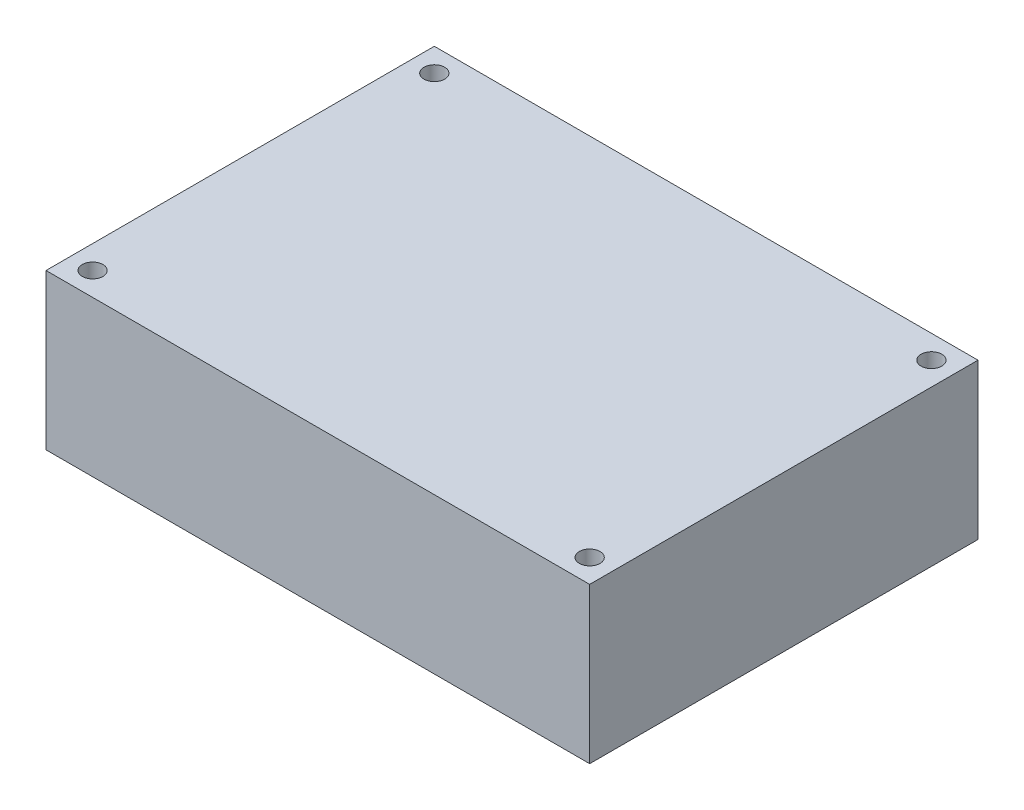
ISO-10303-21;
HEADER;
FILE_DESCRIPTION(('STEP AP214'),'2;1');
FILE_NAME('part.step','',(''),(''),'','','');
FILE_SCHEMA(('AUTOMOTIVE_DESIGN { 1 0 10303 214 1 1 1 1 }'));
ENDSEC;
DATA;
#1=APPLICATION_CONTEXT('core data for automotive mechanical design processes');
#2=APPLICATION_PROTOCOL_DEFINITION('international standard','automotive_design',2000,#1);
#3=PRODUCT_CONTEXT('',#1,'mechanical');
#4=PRODUCT('Part','Part','',(#3));
#5=PRODUCT_RELATED_PRODUCT_CATEGORY('part','',(#4));
#6=PRODUCT_DEFINITION_FORMATION('','',#4);
#7=PRODUCT_DEFINITION_CONTEXT('part definition',#1,'design');
#8=PRODUCT_DEFINITION('design','',#6,#7);
#9=PRODUCT_DEFINITION_SHAPE('','',#8);
#10=(LENGTH_UNIT() NAMED_UNIT(*) SI_UNIT(.MILLI.,.METRE.));
#11=(NAMED_UNIT(*) PLANE_ANGLE_UNIT() SI_UNIT($,.RADIAN.));
#12=(NAMED_UNIT(*) SI_UNIT($,.STERADIAN.) SOLID_ANGLE_UNIT());
#13=UNCERTAINTY_MEASURE_WITH_UNIT(LENGTH_MEASURE(1.E-05),#10,'distance_accuracy_value','');
#14=(GEOMETRIC_REPRESENTATION_CONTEXT(3) GLOBAL_UNCERTAINTY_ASSIGNED_CONTEXT((#13)) GLOBAL_UNIT_ASSIGNED_CONTEXT((#10,
#11,#12)) REPRESENTATION_CONTEXT('',''));
#15=CARTESIAN_POINT('',(0.,0.,0.));
#16=DIRECTION('',(0.,0.,1.));
#17=DIRECTION('',(1.,0.,0.));
#18=AXIS2_PLACEMENT_3D('',#15,#16,#17);
#19=CARTESIAN_POINT('',(-52.5,15.,-37.5));
#20=DIRECTION('',(1.,0.,0.));
#21=DIRECTION('',(0.,0.,-1.));
#22=AXIS2_PLACEMENT_3D('',#19,#20,#21);
#23=PLANE('',#22);
#24=DIRECTION('',(0.,0.,1.));
#25=VECTOR('',#24,1.);
#26=CARTESIAN_POINT('',(-52.5,-15.,-37.5));
#27=LINE('',#26,#25);
#28=CARTESIAN_POINT('',(-52.5,-15.,-37.5));
#29=VERTEX_POINT('',#28);
#30=CARTESIAN_POINT('',(-52.5,-15.,37.5));
#31=VERTEX_POINT('',#30);
#32=EDGE_CURVE('E96',#29,#31,#27,.T.);
#33=ORIENTED_EDGE('',*,*,#32,.T.);
#34=DIRECTION('',(0.,-1.,0.));
#35=VECTOR('',#34,1.);
#36=CARTESIAN_POINT('',(-52.5,15.,37.5));
#37=LINE('',#36,#35);
#38=CARTESIAN_POINT('',(-52.5,15.,37.5));
#39=VERTEX_POINT('',#38);
#40=EDGE_CURVE('E11',#39,#31,#37,.T.);
#41=ORIENTED_EDGE('',*,*,#40,.F.);
#42=DIRECTION('',(0.,0.,1.));
#43=VECTOR('',#42,1.);
#44=CARTESIAN_POINT('',(-52.5,15.,-37.5));
#45=LINE('',#44,#43);
#46=CARTESIAN_POINT('',(-52.5,15.,-37.5));
#47=VERTEX_POINT('',#46);
#48=EDGE_CURVE('E84',#47,#39,#45,.T.);
#49=ORIENTED_EDGE('',*,*,#48,.F.);
#50=DIRECTION('',(0.,-1.,0.));
#51=VECTOR('',#50,1.);
#52=CARTESIAN_POINT('',(-52.5,15.,-37.5));
#53=LINE('',#52,#51);
#54=EDGE_CURVE('E92',#47,#29,#53,.T.);
#55=ORIENTED_EDGE('',*,*,#54,.T.);
#56=EDGE_LOOP('',(#33,#41,#49,#55));
#57=FACE_BOUND('',#56,.T.);
#58=ADVANCED_FACE('F33',(#57),#23,.F.);
#59=CARTESIAN_POINT('',(-52.5,15.,37.5));
#60=DIRECTION('',(0.,0.,-1.));
#61=DIRECTION('',(-1.,0.,0.));
#62=AXIS2_PLACEMENT_3D('',#59,#60,#61);
#63=PLANE('',#62);
#64=DIRECTION('',(1.,0.,0.));
#65=VECTOR('',#64,1.);
#66=CARTESIAN_POINT('',(-52.5,-15.,37.5));
#67=LINE('',#66,#65);
#68=CARTESIAN_POINT('',(52.5,-15.,37.5));
#69=VERTEX_POINT('',#68);
#70=EDGE_CURVE('E88',#31,#69,#67,.T.);
#71=ORIENTED_EDGE('',*,*,#70,.T.);
#72=DIRECTION('',(0.,-1.,0.));
#73=VECTOR('',#72,1.);
#74=CARTESIAN_POINT('',(52.5,15.,37.5));
#75=LINE('',#74,#73);
#76=CARTESIAN_POINT('',(52.5,15.,37.5));
#77=VERTEX_POINT('',#76);
#78=EDGE_CURVE('E41',#77,#69,#75,.T.);
#79=ORIENTED_EDGE('',*,*,#78,.F.);
#80=DIRECTION('',(1.,0.,0.));
#81=VECTOR('',#80,1.);
#82=CARTESIAN_POINT('',(-52.5,15.,37.5));
#83=LINE('',#82,#81);
#84=EDGE_CURVE('E79',#39,#77,#83,.T.);
#85=ORIENTED_EDGE('',*,*,#84,.F.);
#86=ORIENTED_EDGE('',*,*,#40,.T.);
#87=EDGE_LOOP('',(#71,#79,#85,#86));
#88=FACE_BOUND('',#87,.T.);
#89=ADVANCED_FACE('F87',(#88),#63,.F.);
#90=CARTESIAN_POINT('',(52.5,15.,-37.5));
#91=DIRECTION('',(-1.,0.,0.));
#92=DIRECTION('',(0.,0.,1.));
#93=AXIS2_PLACEMENT_3D('',#90,#91,#92);
#94=PLANE('',#93);
#95=DIRECTION('',(0.,0.,-1.));
#96=VECTOR('',#95,1.);
#97=CARTESIAN_POINT('',(52.5,-15.,-37.5));
#98=LINE('',#97,#96);
#99=CARTESIAN_POINT('',(52.5,-15.,-37.5));
#100=VERTEX_POINT('',#99);
#101=EDGE_CURVE('E66',#69,#100,#98,.T.);
#102=ORIENTED_EDGE('',*,*,#101,.T.);
#103=DIRECTION('',(0.,-1.,0.));
#104=VECTOR('',#103,1.);
#105=CARTESIAN_POINT('',(52.5,15.,-37.5));
#106=LINE('',#105,#104);
#107=CARTESIAN_POINT('',(52.5,15.,-37.5));
#108=VERTEX_POINT('',#107);
#109=EDGE_CURVE('E89',#108,#100,#106,.T.);
#110=ORIENTED_EDGE('',*,*,#109,.F.);
#111=DIRECTION('',(0.,0.,-1.));
#112=VECTOR('',#111,1.);
#113=CARTESIAN_POINT('',(52.5,15.,-37.5));
#114=LINE('',#113,#112);
#115=EDGE_CURVE('E82',#77,#108,#114,.T.);
#116=ORIENTED_EDGE('',*,*,#115,.F.);
#117=ORIENTED_EDGE('',*,*,#78,.T.);
#118=EDGE_LOOP('',(#102,#110,#116,#117));
#119=FACE_BOUND('',#118,.T.);
#120=ADVANCED_FACE('F90',(#119),#94,.F.);
#121=CARTESIAN_POINT('',(-52.5,15.,-37.5));
#122=DIRECTION('',(0.,0.,1.));
#123=DIRECTION('',(1.,0.,0.));
#124=AXIS2_PLACEMENT_3D('',#121,#122,#123);
#125=PLANE('',#124);
#126=DIRECTION('',(-1.,0.,0.));
#127=VECTOR('',#126,1.);
#128=CARTESIAN_POINT('',(-52.5,-15.,-37.5));
#129=LINE('',#128,#127);
#130=EDGE_CURVE('E72',#100,#29,#129,.T.);
#131=ORIENTED_EDGE('',*,*,#130,.T.);
#132=ORIENTED_EDGE('',*,*,#54,.F.);
#133=DIRECTION('',(-1.,0.,0.));
#134=VECTOR('',#133,1.);
#135=CARTESIAN_POINT('',(-52.5,15.,-37.5));
#136=LINE('',#135,#134);
#137=EDGE_CURVE('E49',#108,#47,#136,.T.);
#138=ORIENTED_EDGE('',*,*,#137,.F.);
#139=ORIENTED_EDGE('',*,*,#109,.T.);
#140=EDGE_LOOP('',(#131,#132,#138,#139));
#141=FACE_BOUND('',#140,.T.);
#142=ADVANCED_FACE('F104',(#141),#125,.F.);
#143=CARTESIAN_POINT('',(0.,15.,0.));
#144=DIRECTION('',(0.,1.,0.));
#145=DIRECTION('',(0.,0.,1.));
#146=AXIS2_PLACEMENT_3D('',#143,#144,#145);
#147=PLANE('',#146);
#148=CARTESIAN_POINT('',(-48.,15.,-33.));
#149=DIRECTION('',(0.,1.,0.));
#150=DIRECTION('',(0.,0.,1.));
#151=AXIS2_PLACEMENT_3D('',#148,#149,#150);
#152=CIRCLE('',#151,2.);
#153=CARTESIAN_POINT('',(-48.,15.,-31.));
#154=VERTEX_POINT('',#153);
#155=EDGE_CURVE('E130',#154,#154,#152,.T.);
#156=ORIENTED_EDGE('',*,*,#155,.F.);
#157=EDGE_LOOP('',(#156));
#158=FACE_BOUND('',#157,.T.);
#159=CARTESIAN_POINT('',(48.,15.,-33.));
#160=DIRECTION('',(0.,1.,0.));
#161=DIRECTION('',(0.,0.,1.));
#162=AXIS2_PLACEMENT_3D('',#159,#160,#161);
#163=CIRCLE('',#162,2.);
#164=CARTESIAN_POINT('',(48.,15.,-31.));
#165=VERTEX_POINT('',#164);
#166=EDGE_CURVE('E124',#165,#165,#163,.T.);
#167=ORIENTED_EDGE('',*,*,#166,.F.);
#168=EDGE_LOOP('',(#167));
#169=FACE_BOUND('',#168,.T.);
#170=CARTESIAN_POINT('',(48.,15.,33.));
#171=DIRECTION('',(0.,1.,0.));
#172=DIRECTION('',(0.,0.,1.));
#173=AXIS2_PLACEMENT_3D('',#170,#171,#172);
#174=CIRCLE('',#173,2.);
#175=CARTESIAN_POINT('',(48.,15.,35.));
#176=VERTEX_POINT('',#175);
#177=EDGE_CURVE('E118',#176,#176,#174,.T.);
#178=ORIENTED_EDGE('',*,*,#177,.F.);
#179=EDGE_LOOP('',(#178));
#180=FACE_BOUND('',#179,.T.);
#181=CARTESIAN_POINT('',(-48.,15.,33.));
#182=DIRECTION('',(0.,1.,0.));
#183=DIRECTION('',(0.,0.,1.));
#184=AXIS2_PLACEMENT_3D('',#181,#182,#183);
#185=CIRCLE('',#184,2.);
#186=CARTESIAN_POINT('',(-48.,15.,35.));
#187=VERTEX_POINT('',#186);
#188=EDGE_CURVE('E112',#187,#187,#185,.T.);
#189=ORIENTED_EDGE('',*,*,#188,.F.);
#190=EDGE_LOOP('',(#189));
#191=FACE_BOUND('',#190,.T.);
#192=ORIENTED_EDGE('',*,*,#48,.T.);
#193=ORIENTED_EDGE('',*,*,#84,.T.);
#194=ORIENTED_EDGE('',*,*,#115,.T.);
#195=ORIENTED_EDGE('',*,*,#137,.T.);
#196=EDGE_LOOP('',(#192,#193,#194,#195));
#197=FACE_BOUND('',#196,.T.);
#198=ADVANCED_FACE('F80',(#158,#169,#180,#191,#197),#147,.T.);
#199=CARTESIAN_POINT('',(0.,-15.,0.));
#200=DIRECTION('',(0.,1.,0.));
#201=DIRECTION('',(0.,0.,1.));
#202=AXIS2_PLACEMENT_3D('',#199,#200,#201);
#203=PLANE('',#202);
#204=CARTESIAN_POINT('',(-48.,-15.,-33.));
#205=DIRECTION('',(0.,1.,0.));
#206=DIRECTION('',(0.,0.,1.));
#207=AXIS2_PLACEMENT_3D('',#204,#205,#206);
#208=CIRCLE('',#207,1.99999999999999);
#209=CARTESIAN_POINT('',(-48.,-15.,-31.));
#210=VERTEX_POINT('',#209);
#211=EDGE_CURVE('E127',#210,#210,#208,.T.);
#212=ORIENTED_EDGE('',*,*,#211,.T.);
#213=EDGE_LOOP('',(#212));
#214=FACE_BOUND('',#213,.T.);
#215=CARTESIAN_POINT('',(48.,-15.,-33.));
#216=DIRECTION('',(0.,1.,0.));
#217=DIRECTION('',(0.,0.,1.));
#218=AXIS2_PLACEMENT_3D('',#215,#216,#217);
#219=CIRCLE('',#218,1.99999999999999);
#220=CARTESIAN_POINT('',(48.,-15.,-31.));
#221=VERTEX_POINT('',#220);
#222=EDGE_CURVE('E121',#221,#221,#219,.T.);
#223=ORIENTED_EDGE('',*,*,#222,.T.);
#224=EDGE_LOOP('',(#223));
#225=FACE_BOUND('',#224,.T.);
#226=CARTESIAN_POINT('',(48.,-15.,33.));
#227=DIRECTION('',(0.,1.,0.));
#228=DIRECTION('',(0.,0.,1.));
#229=AXIS2_PLACEMENT_3D('',#226,#227,#228);
#230=CIRCLE('',#229,1.99999999999999);
#231=CARTESIAN_POINT('',(48.,-15.,35.));
#232=VERTEX_POINT('',#231);
#233=EDGE_CURVE('E115',#232,#232,#230,.T.);
#234=ORIENTED_EDGE('',*,*,#233,.T.);
#235=EDGE_LOOP('',(#234));
#236=FACE_BOUND('',#235,.T.);
#237=CARTESIAN_POINT('',(-48.,-15.,33.));
#238=DIRECTION('',(0.,1.,0.));
#239=DIRECTION('',(0.,0.,1.));
#240=AXIS2_PLACEMENT_3D('',#237,#238,#239);
#241=CIRCLE('',#240,1.99999999999999);
#242=CARTESIAN_POINT('',(-48.,-15.,35.));
#243=VERTEX_POINT('',#242);
#244=EDGE_CURVE('E99',#243,#243,#241,.T.);
#245=ORIENTED_EDGE('',*,*,#244,.T.);
#246=EDGE_LOOP('',(#245));
#247=FACE_BOUND('',#246,.T.);
#248=ORIENTED_EDGE('',*,*,#32,.F.);
#249=ORIENTED_EDGE('',*,*,#130,.F.);
#250=ORIENTED_EDGE('',*,*,#101,.F.);
#251=ORIENTED_EDGE('',*,*,#70,.F.);
#252=EDGE_LOOP('',(#248,#249,#250,#251));
#253=FACE_BOUND('',#252,.T.);
#254=ADVANCED_FACE('F107',(#214,#225,#236,#247,#253),#203,.F.);
#255=CARTESIAN_POINT('',(-48.,15.,33.));
#256=DIRECTION('',(0.,1.,0.));
#257=DIRECTION('',(0.,0.,1.));
#258=AXIS2_PLACEMENT_3D('',#255,#256,#257);
#259=CYLINDRICAL_SURFACE('',#258,2.);
#260=ORIENTED_EDGE('',*,*,#244,.F.);
#261=EDGE_LOOP('',(#260));
#262=FACE_BOUND('',#261,.T.);
#263=ORIENTED_EDGE('',*,*,#188,.T.);
#264=EDGE_LOOP('',(#263));
#265=FACE_BOUND('',#264,.T.);
#266=ADVANCED_FACE('F145',(#262,#265),#259,.F.);
#267=CARTESIAN_POINT('',(48.,15.,33.));
#268=DIRECTION('',(0.,1.,0.));
#269=DIRECTION('',(0.,0.,1.));
#270=AXIS2_PLACEMENT_3D('',#267,#268,#269);
#271=CYLINDRICAL_SURFACE('',#270,2.);
#272=ORIENTED_EDGE('',*,*,#233,.F.);
#273=EDGE_LOOP('',(#272));
#274=FACE_BOUND('',#273,.T.);
#275=ORIENTED_EDGE('',*,*,#177,.T.);
#276=EDGE_LOOP('',(#275));
#277=FACE_BOUND('',#276,.T.);
#278=ADVANCED_FACE('F147',(#274,#277),#271,.F.);
#279=CARTESIAN_POINT('',(48.,15.,-33.));
#280=DIRECTION('',(0.,1.,0.));
#281=DIRECTION('',(0.,0.,1.));
#282=AXIS2_PLACEMENT_3D('',#279,#280,#281);
#283=CYLINDRICAL_SURFACE('',#282,2.);
#284=ORIENTED_EDGE('',*,*,#222,.F.);
#285=EDGE_LOOP('',(#284));
#286=FACE_BOUND('',#285,.T.);
#287=ORIENTED_EDGE('',*,*,#166,.T.);
#288=EDGE_LOOP('',(#287));
#289=FACE_BOUND('',#288,.T.);
#290=ADVANCED_FACE('F154',(#286,#289),#283,.F.);
#291=CARTESIAN_POINT('',(-48.,15.,-33.));
#292=DIRECTION('',(0.,1.,0.));
#293=DIRECTION('',(0.,0.,1.));
#294=AXIS2_PLACEMENT_3D('',#291,#292,#293);
#295=CYLINDRICAL_SURFACE('',#294,2.);
#296=ORIENTED_EDGE('',*,*,#211,.F.);
#297=EDGE_LOOP('',(#296));
#298=FACE_BOUND('',#297,.T.);
#299=ORIENTED_EDGE('',*,*,#155,.T.);
#300=EDGE_LOOP('',(#299));
#301=FACE_BOUND('',#300,.T.);
#302=ADVANCED_FACE('F134',(#298,#301),#295,.F.);
#303=CLOSED_SHELL('',(#58,#89,#120,#142,#198,#254,#266,#278,#290,#302));
#304=MANIFOLD_SOLID_BREP('B2',#303);
#305=ADVANCED_BREP_SHAPE_REPRESENTATION('',(#18,#304),#14);
#306=SHAPE_DEFINITION_REPRESENTATION(#9,#305);
ENDSEC;
END-ISO-10303-21;
